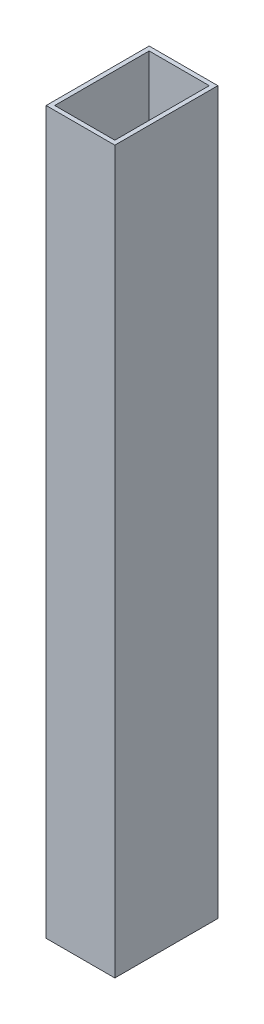
ISO-10303-21;
HEADER;
FILE_DESCRIPTION(('STEP AP214'),'2;1');
FILE_NAME('part.step','',(''),(''),'','','');
FILE_SCHEMA(('AUTOMOTIVE_DESIGN { 1 0 10303 214 1 1 1 1 }'));
ENDSEC;
DATA;
#1=APPLICATION_CONTEXT('core data for automotive mechanical design processes');
#2=APPLICATION_PROTOCOL_DEFINITION('international standard','automotive_design',2000,#1);
#3=PRODUCT_CONTEXT('',#1,'mechanical');
#4=PRODUCT('Part','Part','',(#3));
#5=PRODUCT_RELATED_PRODUCT_CATEGORY('part','',(#4));
#6=PRODUCT_DEFINITION_FORMATION('','',#4);
#7=PRODUCT_DEFINITION_CONTEXT('part definition',#1,'design');
#8=PRODUCT_DEFINITION('design','',#6,#7);
#9=PRODUCT_DEFINITION_SHAPE('','',#8);
#10=(LENGTH_UNIT() NAMED_UNIT(*) SI_UNIT(.MILLI.,.METRE.));
#11=(NAMED_UNIT(*) PLANE_ANGLE_UNIT() SI_UNIT($,.RADIAN.));
#12=(NAMED_UNIT(*) SI_UNIT($,.STERADIAN.) SOLID_ANGLE_UNIT());
#13=UNCERTAINTY_MEASURE_WITH_UNIT(LENGTH_MEASURE(1.E-05),#10,'distance_accuracy_value','');
#14=(GEOMETRIC_REPRESENTATION_CONTEXT(3) GLOBAL_UNCERTAINTY_ASSIGNED_CONTEXT((#13)) GLOBAL_UNIT_ASSIGNED_CONTEXT((#10,
#11,#12)) REPRESENTATION_CONTEXT('',''));
#15=CARTESIAN_POINT('',(0.,0.,0.));
#16=DIRECTION('',(0.,0.,1.));
#17=DIRECTION('',(1.,0.,0.));
#18=AXIS2_PLACEMENT_3D('',#15,#16,#17);
#19=CARTESIAN_POINT('',(25.4,-533.4,38.1));
#20=DIRECTION('',(0.,-1.,0.));
#21=DIRECTION('',(1.,0.,0.));
#22=AXIS2_PLACEMENT_3D('',#19,#20,#21);
#23=PLANE('',#22);
#24=DIRECTION('',(0.,0.,1.));
#25=VECTOR('',#24,1.);
#26=CARTESIAN_POINT('',(0.,-533.4,38.1));
#27=LINE('',#26,#25);
#28=CARTESIAN_POINT('',(0.,-533.4,0.));
#29=VERTEX_POINT('',#28);
#30=CARTESIAN_POINT('',(0.,-533.4,76.2));
#31=VERTEX_POINT('',#30);
#32=EDGE_CURVE('E142',#29,#31,#27,.T.);
#33=ORIENTED_EDGE('',*,*,#32,.F.);
#34=DIRECTION('',(1.,0.,0.));
#35=VECTOR('',#34,1.);
#36=CARTESIAN_POINT('',(25.4,-533.4,0.));
#37=LINE('',#36,#35);
#38=CARTESIAN_POINT('',(50.8,-533.4,0.));
#39=VERTEX_POINT('',#38);
#40=EDGE_CURVE('E146',#29,#39,#37,.T.);
#41=ORIENTED_EDGE('',*,*,#40,.T.);
#42=DIRECTION('',(0.,0.,1.));
#43=VECTOR('',#42,1.);
#44=CARTESIAN_POINT('',(50.8,-533.4,38.1));
#45=LINE('',#44,#43);
#46=CARTESIAN_POINT('',(50.8,-533.4,76.2));
#47=VERTEX_POINT('',#46);
#48=EDGE_CURVE('E150',#39,#47,#45,.T.);
#49=ORIENTED_EDGE('',*,*,#48,.T.);
#50=DIRECTION('',(1.,0.,0.));
#51=VECTOR('',#50,1.);
#52=CARTESIAN_POINT('',(25.4,-533.4,76.2));
#53=LINE('',#52,#51);
#54=EDGE_CURVE('E153',#31,#47,#53,.T.);
#55=ORIENTED_EDGE('',*,*,#54,.F.);
#56=EDGE_LOOP('',(#33,#41,#49,#55));
#57=FACE_BOUND('',#56,.T.);
#58=DIRECTION('',(1.,0.,0.));
#59=VECTOR('',#58,1.);
#60=CARTESIAN_POINT('',(25.4,-533.4,3.175));
#61=LINE('',#60,#59);
#62=CARTESIAN_POINT('',(3.175,-533.4,3.175));
#63=VERTEX_POINT('',#62);
#64=CARTESIAN_POINT('',(47.625,-533.4,3.175));
#65=VERTEX_POINT('',#64);
#66=EDGE_CURVE('E129',#63,#65,#61,.T.);
#67=ORIENTED_EDGE('',*,*,#66,.F.);
#68=DIRECTION('',(0.,0.,1.));
#69=VECTOR('',#68,1.);
#70=CARTESIAN_POINT('',(3.175,-533.4,38.1));
#71=LINE('',#70,#69);
#72=CARTESIAN_POINT('',(3.175,-533.4,73.025));
#73=VERTEX_POINT('',#72);
#74=EDGE_CURVE('E123',#63,#73,#71,.T.);
#75=ORIENTED_EDGE('',*,*,#74,.T.);
#76=DIRECTION('',(1.,0.,0.));
#77=VECTOR('',#76,1.);
#78=CARTESIAN_POINT('',(25.4,-533.4,73.025));
#79=LINE('',#78,#77);
#80=CARTESIAN_POINT('',(47.625,-533.4,73.025));
#81=VERTEX_POINT('',#80);
#82=EDGE_CURVE('E105',#73,#81,#79,.T.);
#83=ORIENTED_EDGE('',*,*,#82,.T.);
#84=DIRECTION('',(0.,0.,1.));
#85=VECTOR('',#84,1.);
#86=CARTESIAN_POINT('',(47.625,-533.4,38.1));
#87=LINE('',#86,#85);
#88=EDGE_CURVE('E138',#65,#81,#87,.T.);
#89=ORIENTED_EDGE('',*,*,#88,.F.);
#90=EDGE_LOOP('',(#67,#75,#83,#89));
#91=FACE_BOUND('',#90,.T.);
#92=ADVANCED_FACE('F14',(#57,#91),#23,.T.);
#93=CARTESIAN_POINT('',(25.4,0.,38.1));
#94=DIRECTION('',(0.,-1.,0.));
#95=DIRECTION('',(1.,0.,0.));
#96=AXIS2_PLACEMENT_3D('',#93,#94,#95);
#97=PLANE('',#96);
#98=DIRECTION('',(0.,0.,1.));
#99=VECTOR('',#98,1.);
#100=CARTESIAN_POINT('',(0.,0.,38.1));
#101=LINE('',#100,#99);
#102=CARTESIAN_POINT('',(0.,0.,0.));
#103=VERTEX_POINT('',#102);
#104=CARTESIAN_POINT('',(0.,0.,76.2));
#105=VERTEX_POINT('',#104);
#106=EDGE_CURVE('E158',#103,#105,#101,.T.);
#107=ORIENTED_EDGE('',*,*,#106,.T.);
#108=DIRECTION('',(1.,0.,0.));
#109=VECTOR('',#108,1.);
#110=CARTESIAN_POINT('',(25.4,0.,76.2));
#111=LINE('',#110,#109);
#112=CARTESIAN_POINT('',(50.8,0.,76.2));
#113=VERTEX_POINT('',#112);
#114=EDGE_CURVE('E147',#105,#113,#111,.T.);
#115=ORIENTED_EDGE('',*,*,#114,.T.);
#116=DIRECTION('',(0.,0.,1.));
#117=VECTOR('',#116,1.);
#118=CARTESIAN_POINT('',(50.8,0.,38.1));
#119=LINE('',#118,#117);
#120=CARTESIAN_POINT('',(50.8,0.,0.));
#121=VERTEX_POINT('',#120);
#122=EDGE_CURVE('E165',#121,#113,#119,.T.);
#123=ORIENTED_EDGE('',*,*,#122,.F.);
#124=DIRECTION('',(1.,0.,0.));
#125=VECTOR('',#124,1.);
#126=CARTESIAN_POINT('',(25.4,0.,0.));
#127=LINE('',#126,#125);
#128=EDGE_CURVE('E162',#103,#121,#127,.T.);
#129=ORIENTED_EDGE('',*,*,#128,.F.);
#130=EDGE_LOOP('',(#107,#115,#123,#129));
#131=FACE_BOUND('',#130,.T.);
#132=DIRECTION('',(0.,0.,1.));
#133=VECTOR('',#132,1.);
#134=CARTESIAN_POINT('',(3.175,0.,38.1));
#135=LINE('',#134,#133);
#136=CARTESIAN_POINT('',(3.175,0.,3.175));
#137=VERTEX_POINT('',#136);
#138=CARTESIAN_POINT('',(3.175,0.,73.025));
#139=VERTEX_POINT('',#138);
#140=EDGE_CURVE('E112',#137,#139,#135,.T.);
#141=ORIENTED_EDGE('',*,*,#140,.F.);
#142=DIRECTION('',(1.,0.,0.));
#143=VECTOR('',#142,1.);
#144=CARTESIAN_POINT('',(25.4,0.,3.175));
#145=LINE('',#144,#143);
#146=CARTESIAN_POINT('',(47.625,0.,3.175));
#147=VERTEX_POINT('',#146);
#148=EDGE_CURVE('E119',#137,#147,#145,.T.);
#149=ORIENTED_EDGE('',*,*,#148,.T.);
#150=DIRECTION('',(0.,0.,1.));
#151=VECTOR('',#150,1.);
#152=CARTESIAN_POINT('',(47.625,0.,38.1));
#153=LINE('',#152,#151);
#154=CARTESIAN_POINT('',(47.625,0.,73.025));
#155=VERTEX_POINT('',#154);
#156=EDGE_CURVE('E46',#147,#155,#153,.T.);
#157=ORIENTED_EDGE('',*,*,#156,.T.);
#158=DIRECTION('',(1.,0.,0.));
#159=VECTOR('',#158,1.);
#160=CARTESIAN_POINT('',(25.4,0.,73.025));
#161=LINE('',#160,#159);
#162=EDGE_CURVE('E103',#139,#155,#161,.T.);
#163=ORIENTED_EDGE('',*,*,#162,.F.);
#164=EDGE_LOOP('',(#141,#149,#157,#163));
#165=FACE_BOUND('',#164,.T.);
#166=ADVANCED_FACE('F121',(#131,#165),#97,.F.);
#167=CARTESIAN_POINT('',(0.,-533.4,38.1));
#168=DIRECTION('',(-1.,0.,0.));
#169=DIRECTION('',(0.,0.,1.));
#170=AXIS2_PLACEMENT_3D('',#167,#168,#169);
#171=PLANE('',#170);
#172=ORIENTED_EDGE('',*,*,#106,.F.);
#173=DIRECTION('',(0.,1.,0.));
#174=VECTOR('',#173,1.);
#175=CARTESIAN_POINT('',(0.,-533.4,0.));
#176=LINE('',#175,#174);
#177=EDGE_CURVE('E9',#29,#103,#176,.T.);
#178=ORIENTED_EDGE('',*,*,#177,.F.);
#179=ORIENTED_EDGE('',*,*,#32,.T.);
#180=DIRECTION('',(0.,1.,0.));
#181=VECTOR('',#180,1.);
#182=CARTESIAN_POINT('',(0.,-533.4,76.2));
#183=LINE('',#182,#181);
#184=EDGE_CURVE('E157',#31,#105,#183,.T.);
#185=ORIENTED_EDGE('',*,*,#184,.T.);
#186=EDGE_LOOP('',(#172,#178,#179,#185));
#187=FACE_BOUND('',#186,.T.);
#188=ADVANCED_FACE('F16',(#187),#171,.T.);
#189=CARTESIAN_POINT('',(25.4,-533.4,0.));
#190=DIRECTION('',(0.,0.,1.));
#191=DIRECTION('',(1.,0.,0.));
#192=AXIS2_PLACEMENT_3D('',#189,#190,#191);
#193=PLANE('',#192);
#194=ORIENTED_EDGE('',*,*,#128,.T.);
#195=DIRECTION('',(0.,1.,0.));
#196=VECTOR('',#195,1.);
#197=CARTESIAN_POINT('',(50.8,-533.4,0.));
#198=LINE('',#197,#196);
#199=EDGE_CURVE('E23',#39,#121,#198,.T.);
#200=ORIENTED_EDGE('',*,*,#199,.F.);
#201=ORIENTED_EDGE('',*,*,#40,.F.);
#202=ORIENTED_EDGE('',*,*,#177,.T.);
#203=EDGE_LOOP('',(#194,#200,#201,#202));
#204=FACE_BOUND('',#203,.T.);
#205=ADVANCED_FACE('F197',(#204),#193,.F.);
#206=CARTESIAN_POINT('',(50.8,-533.4,38.1));
#207=DIRECTION('',(-1.,0.,0.));
#208=DIRECTION('',(0.,0.,1.));
#209=AXIS2_PLACEMENT_3D('',#206,#207,#208);
#210=PLANE('',#209);
#211=ORIENTED_EDGE('',*,*,#122,.T.);
#212=DIRECTION('',(0.,1.,0.));
#213=VECTOR('',#212,1.);
#214=CARTESIAN_POINT('',(50.8,-533.4,76.2));
#215=LINE('',#214,#213);
#216=EDGE_CURVE('E174',#47,#113,#215,.T.);
#217=ORIENTED_EDGE('',*,*,#216,.F.);
#218=ORIENTED_EDGE('',*,*,#48,.F.);
#219=ORIENTED_EDGE('',*,*,#199,.T.);
#220=EDGE_LOOP('',(#211,#217,#218,#219));
#221=FACE_BOUND('',#220,.T.);
#222=ADVANCED_FACE('F183',(#221),#210,.F.);
#223=CARTESIAN_POINT('',(25.4,-533.4,76.2));
#224=DIRECTION('',(0.,0.,1.));
#225=DIRECTION('',(1.,0.,0.));
#226=AXIS2_PLACEMENT_3D('',#223,#224,#225);
#227=PLANE('',#226);
#228=ORIENTED_EDGE('',*,*,#114,.F.);
#229=ORIENTED_EDGE('',*,*,#184,.F.);
#230=ORIENTED_EDGE('',*,*,#54,.T.);
#231=ORIENTED_EDGE('',*,*,#216,.T.);
#232=EDGE_LOOP('',(#228,#229,#230,#231));
#233=FACE_BOUND('',#232,.T.);
#234=ADVANCED_FACE('F192',(#233),#227,.T.);
#235=CARTESIAN_POINT('',(3.175,-533.4,38.1));
#236=DIRECTION('',(-1.,0.,0.));
#237=DIRECTION('',(0.,0.,1.));
#238=AXIS2_PLACEMENT_3D('',#235,#236,#237);
#239=PLANE('',#238);
#240=ORIENTED_EDGE('',*,*,#140,.T.);
#241=DIRECTION('',(0.,1.,0.));
#242=VECTOR('',#241,1.);
#243=CARTESIAN_POINT('',(3.175,-533.4,73.025));
#244=LINE('',#243,#242);
#245=EDGE_CURVE('E99',#73,#139,#244,.T.);
#246=ORIENTED_EDGE('',*,*,#245,.F.);
#247=ORIENTED_EDGE('',*,*,#74,.F.);
#248=DIRECTION('',(0.,1.,0.));
#249=VECTOR('',#248,1.);
#250=CARTESIAN_POINT('',(3.175,-533.4,3.175));
#251=LINE('',#250,#249);
#252=EDGE_CURVE('E114',#63,#137,#251,.T.);
#253=ORIENTED_EDGE('',*,*,#252,.T.);
#254=EDGE_LOOP('',(#240,#246,#247,#253));
#255=FACE_BOUND('',#254,.T.);
#256=ADVANCED_FACE('F113',(#255),#239,.F.);
#257=CARTESIAN_POINT('',(25.4,-533.4,3.175));
#258=DIRECTION('',(0.,0.,1.));
#259=DIRECTION('',(1.,0.,0.));
#260=AXIS2_PLACEMENT_3D('',#257,#258,#259);
#261=PLANE('',#260);
#262=ORIENTED_EDGE('',*,*,#148,.F.);
#263=ORIENTED_EDGE('',*,*,#252,.F.);
#264=ORIENTED_EDGE('',*,*,#66,.T.);
#265=DIRECTION('',(0.,1.,0.));
#266=VECTOR('',#265,1.);
#267=CARTESIAN_POINT('',(47.625,-533.4,3.175));
#268=LINE('',#267,#266);
#269=EDGE_CURVE('E367',#65,#147,#268,.T.);
#270=ORIENTED_EDGE('',*,*,#269,.T.);
#271=EDGE_LOOP('',(#262,#263,#264,#270));
#272=FACE_BOUND('',#271,.T.);
#273=ADVANCED_FACE('F232',(#272),#261,.T.);
#274=CARTESIAN_POINT('',(47.625,-533.4,38.1));
#275=DIRECTION('',(-1.,0.,0.));
#276=DIRECTION('',(0.,0.,1.));
#277=AXIS2_PLACEMENT_3D('',#274,#275,#276);
#278=PLANE('',#277);
#279=ORIENTED_EDGE('',*,*,#156,.F.);
#280=ORIENTED_EDGE('',*,*,#269,.F.);
#281=ORIENTED_EDGE('',*,*,#88,.T.);
#282=DIRECTION('',(0.,1.,0.));
#283=VECTOR('',#282,1.);
#284=CARTESIAN_POINT('',(47.625,-533.4,73.025));
#285=LINE('',#284,#283);
#286=EDGE_CURVE('E35',#81,#155,#285,.T.);
#287=ORIENTED_EDGE('',*,*,#286,.T.);
#288=EDGE_LOOP('',(#279,#280,#281,#287));
#289=FACE_BOUND('',#288,.T.);
#290=ADVANCED_FACE('F239',(#289),#278,.T.);
#291=CARTESIAN_POINT('',(25.4,-533.4,73.025));
#292=DIRECTION('',(0.,0.,1.));
#293=DIRECTION('',(1.,0.,0.));
#294=AXIS2_PLACEMENT_3D('',#291,#292,#293);
#295=PLANE('',#294);
#296=ORIENTED_EDGE('',*,*,#162,.T.);
#297=ORIENTED_EDGE('',*,*,#286,.F.);
#298=ORIENTED_EDGE('',*,*,#82,.F.);
#299=ORIENTED_EDGE('',*,*,#245,.T.);
#300=EDGE_LOOP('',(#296,#297,#298,#299));
#301=FACE_BOUND('',#300,.T.);
#302=ADVANCED_FACE('F101',(#301),#295,.F.);
#303=CLOSED_SHELL('',(#92,#166,#188,#205,#222,#234,#256,#273,#290,#302));
#304=MANIFOLD_SOLID_BREP('B1',#303);
#305=ADVANCED_BREP_SHAPE_REPRESENTATION('',(#18,#304),#14);
#306=SHAPE_DEFINITION_REPRESENTATION(#9,#305);
ENDSEC;
END-ISO-10303-21;
